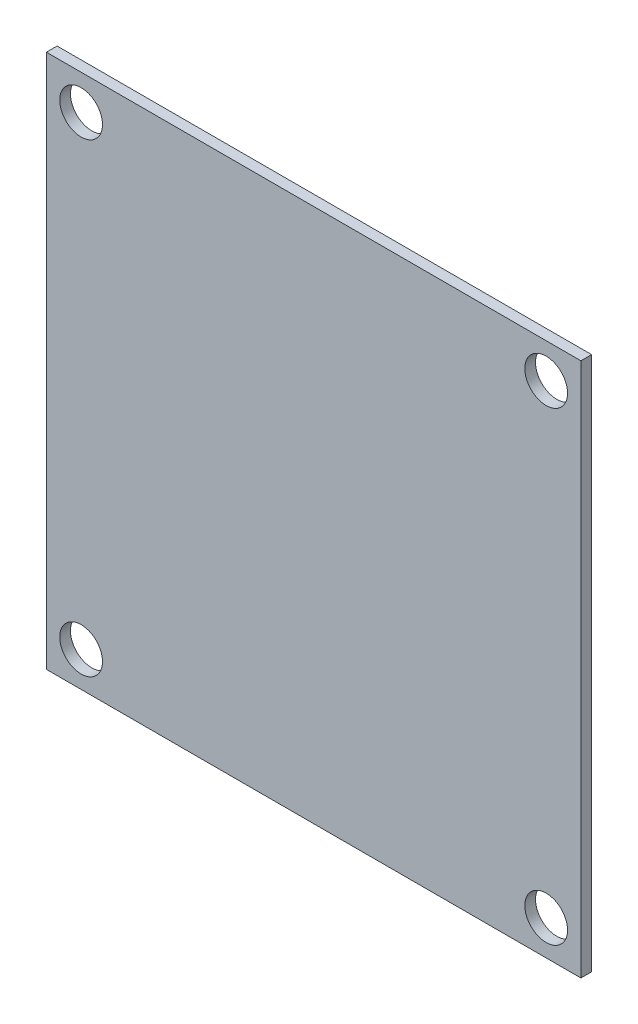
ISO-10303-21;
HEADER;
FILE_DESCRIPTION(('STEP AP214'),'2;1');
FILE_NAME('part.step','',(''),(''),'','','');
FILE_SCHEMA(('AUTOMOTIVE_DESIGN { 1 0 10303 214 1 1 1 1 }'));
ENDSEC;
DATA;
#1=APPLICATION_CONTEXT('core data for automotive mechanical design processes');
#2=APPLICATION_PROTOCOL_DEFINITION('international standard','automotive_design',2000,#1);
#3=PRODUCT_CONTEXT('',#1,'mechanical');
#4=PRODUCT('Part','Part','',(#3));
#5=PRODUCT_RELATED_PRODUCT_CATEGORY('part','',(#4));
#6=PRODUCT_DEFINITION_FORMATION('','',#4);
#7=PRODUCT_DEFINITION_CONTEXT('part definition',#1,'design');
#8=PRODUCT_DEFINITION('design','',#6,#7);
#9=PRODUCT_DEFINITION_SHAPE('','',#8);
#10=(LENGTH_UNIT() NAMED_UNIT(*) SI_UNIT(.MILLI.,.METRE.));
#11=(NAMED_UNIT(*) PLANE_ANGLE_UNIT() SI_UNIT($,.RADIAN.));
#12=(NAMED_UNIT(*) SI_UNIT($,.STERADIAN.) SOLID_ANGLE_UNIT());
#13=UNCERTAINTY_MEASURE_WITH_UNIT(LENGTH_MEASURE(1.E-05),#10,'distance_accuracy_value','');
#14=(GEOMETRIC_REPRESENTATION_CONTEXT(3) GLOBAL_UNCERTAINTY_ASSIGNED_CONTEXT((#13)) GLOBAL_UNIT_ASSIGNED_CONTEXT((#10,
#11,#12)) REPRESENTATION_CONTEXT('',''));
#15=CARTESIAN_POINT('',(0.,0.,0.));
#16=DIRECTION('',(0.,0.,1.));
#17=DIRECTION('',(1.,0.,0.));
#18=AXIS2_PLACEMENT_3D('',#15,#16,#17);
#19=CARTESIAN_POINT('',(0.,0.,0.8));
#20=DIRECTION('',(0.,0.,1.));
#21=DIRECTION('',(1.,0.,0.));
#22=AXIS2_PLACEMENT_3D('',#19,#20,#21);
#23=PLANE('',#22);
#24=CARTESIAN_POINT('',(17.4,17.4,0.8));
#25=DIRECTION('',(0.,0.,1.));
#26=DIRECTION('',(1.,0.,0.));
#27=AXIS2_PLACEMENT_3D('',#24,#25,#26);
#28=CIRCLE('',#27,1.6);
#29=CARTESIAN_POINT('',(19.,17.4,0.8));
#30=VERTEX_POINT('',#29);
#31=EDGE_CURVE('E120',#30,#30,#28,.T.);
#32=ORIENTED_EDGE('',*,*,#31,.F.);
#33=EDGE_LOOP('',(#32));
#34=FACE_BOUND('',#33,.T.);
#35=CARTESIAN_POINT('',(-17.4,-17.4,0.8));
#36=DIRECTION('',(0.,0.,1.));
#37=DIRECTION('',(1.,0.,0.));
#38=AXIS2_PLACEMENT_3D('',#35,#36,#37);
#39=CIRCLE('',#38,1.6);
#40=CARTESIAN_POINT('',(-15.8,-17.4,0.8));
#41=VERTEX_POINT('',#40);
#42=EDGE_CURVE('E99',#41,#41,#39,.T.);
#43=ORIENTED_EDGE('',*,*,#42,.F.);
#44=EDGE_LOOP('',(#43));
#45=FACE_BOUND('',#44,.T.);
#46=DIRECTION('',(0.,1.,0.));
#47=VECTOR('',#46,1.);
#48=CARTESIAN_POINT('',(20.,20.,0.8));
#49=LINE('',#48,#47);
#50=CARTESIAN_POINT('',(20.,-20.,0.8));
#51=VERTEX_POINT('',#50);
#52=CARTESIAN_POINT('',(20.,20.,0.8));
#53=VERTEX_POINT('',#52);
#54=EDGE_CURVE('E84',#51,#53,#49,.T.);
#55=ORIENTED_EDGE('',*,*,#54,.T.);
#56=DIRECTION('',(-1.,0.,0.));
#57=VECTOR('',#56,1.);
#58=CARTESIAN_POINT('',(-20.,20.,0.8));
#59=LINE('',#58,#57);
#60=CARTESIAN_POINT('',(-20.,20.,0.8));
#61=VERTEX_POINT('',#60);
#62=EDGE_CURVE('E79',#53,#61,#59,.T.);
#63=ORIENTED_EDGE('',*,*,#62,.T.);
#64=DIRECTION('',(0.,-1.,0.));
#65=VECTOR('',#64,1.);
#66=CARTESIAN_POINT('',(-20.,20.,0.8));
#67=LINE('',#66,#65);
#68=CARTESIAN_POINT('',(-20.,-20.,0.8));
#69=VERTEX_POINT('',#68);
#70=EDGE_CURVE('E82',#61,#69,#67,.T.);
#71=ORIENTED_EDGE('',*,*,#70,.T.);
#72=DIRECTION('',(1.,0.,0.));
#73=VECTOR('',#72,1.);
#74=CARTESIAN_POINT('',(-20.,-20.,0.8));
#75=LINE('',#74,#73);
#76=EDGE_CURVE('E49',#69,#51,#75,.T.);
#77=ORIENTED_EDGE('',*,*,#76,.T.);
#78=EDGE_LOOP('',(#55,#63,#71,#77));
#79=FACE_BOUND('',#78,.T.);
#80=CARTESIAN_POINT('',(-17.4,17.4,0.8));
#81=DIRECTION('',(0.,0.,1.));
#82=DIRECTION('',(1.,0.,0.));
#83=AXIS2_PLACEMENT_3D('',#80,#81,#82);
#84=CIRCLE('',#83,1.6);
#85=CARTESIAN_POINT('',(-15.8,17.4,0.8));
#86=VERTEX_POINT('',#85);
#87=EDGE_CURVE('E114',#86,#86,#84,.T.);
#88=ORIENTED_EDGE('',*,*,#87,.F.);
#89=EDGE_LOOP('',(#88));
#90=FACE_BOUND('',#89,.T.);
#91=CARTESIAN_POINT('',(17.4,-17.4,0.8));
#92=DIRECTION('',(0.,0.,1.));
#93=DIRECTION('',(1.,0.,0.));
#94=AXIS2_PLACEMENT_3D('',#91,#92,#93);
#95=CIRCLE('',#94,1.6);
#96=CARTESIAN_POINT('',(19.,-17.4,0.8));
#97=VERTEX_POINT('',#96);
#98=EDGE_CURVE('E126',#97,#97,#95,.T.);
#99=ORIENTED_EDGE('',*,*,#98,.F.);
#100=EDGE_LOOP('',(#99));
#101=FACE_BOUND('',#100,.T.);
#102=ADVANCED_FACE('F32',(#34,#45,#79,#90,#101),#23,.T.);
#103=CARTESIAN_POINT('',(0.,0.,0.));
#104=DIRECTION('',(0.,0.,1.));
#105=DIRECTION('',(1.,0.,0.));
#106=AXIS2_PLACEMENT_3D('',#103,#104,#105);
#107=PLANE('',#106);
#108=CARTESIAN_POINT('',(17.4,17.4,0.));
#109=DIRECTION('',(0.,0.,1.));
#110=DIRECTION('',(1.,0.,0.));
#111=AXIS2_PLACEMENT_3D('',#108,#109,#110);
#112=CIRCLE('',#111,1.6);
#113=CARTESIAN_POINT('',(19.,17.4,0.));
#114=VERTEX_POINT('',#113);
#115=EDGE_CURVE('E123',#114,#114,#112,.T.);
#116=ORIENTED_EDGE('',*,*,#115,.T.);
#117=EDGE_LOOP('',(#116));
#118=FACE_BOUND('',#117,.T.);
#119=CARTESIAN_POINT('',(-17.4,-17.4,0.));
#120=DIRECTION('',(0.,0.,1.));
#121=DIRECTION('',(1.,0.,0.));
#122=AXIS2_PLACEMENT_3D('',#119,#120,#121);
#123=CIRCLE('',#122,1.6);
#124=CARTESIAN_POINT('',(-15.8,-17.4,0.));
#125=VERTEX_POINT('',#124);
#126=EDGE_CURVE('E111',#125,#125,#123,.T.);
#127=ORIENTED_EDGE('',*,*,#126,.T.);
#128=EDGE_LOOP('',(#127));
#129=FACE_BOUND('',#128,.T.);
#130=DIRECTION('',(0.,1.,0.));
#131=VECTOR('',#130,1.);
#132=CARTESIAN_POINT('',(20.,20.,0.));
#133=LINE('',#132,#131);
#134=CARTESIAN_POINT('',(20.,-20.,0.));
#135=VERTEX_POINT('',#134);
#136=CARTESIAN_POINT('',(20.,20.,0.));
#137=VERTEX_POINT('',#136);
#138=EDGE_CURVE('E96',#135,#137,#133,.T.);
#139=ORIENTED_EDGE('',*,*,#138,.F.);
#140=DIRECTION('',(1.,0.,0.));
#141=VECTOR('',#140,1.);
#142=CARTESIAN_POINT('',(-20.,-20.,0.));
#143=LINE('',#142,#141);
#144=CARTESIAN_POINT('',(-20.,-20.,0.));
#145=VERTEX_POINT('',#144);
#146=EDGE_CURVE('E72',#145,#135,#143,.T.);
#147=ORIENTED_EDGE('',*,*,#146,.F.);
#148=DIRECTION('',(0.,-1.,0.));
#149=VECTOR('',#148,1.);
#150=CARTESIAN_POINT('',(-20.,20.,0.));
#151=LINE('',#150,#149);
#152=CARTESIAN_POINT('',(-20.,20.,0.));
#153=VERTEX_POINT('',#152);
#154=EDGE_CURVE('E66',#153,#145,#151,.T.);
#155=ORIENTED_EDGE('',*,*,#154,.F.);
#156=DIRECTION('',(-1.,0.,0.));
#157=VECTOR('',#156,1.);
#158=CARTESIAN_POINT('',(-20.,20.,0.));
#159=LINE('',#158,#157);
#160=EDGE_CURVE('E88',#137,#153,#159,.T.);
#161=ORIENTED_EDGE('',*,*,#160,.F.);
#162=EDGE_LOOP('',(#139,#147,#155,#161));
#163=FACE_BOUND('',#162,.T.);
#164=CARTESIAN_POINT('',(-17.4,17.4,0.));
#165=DIRECTION('',(0.,0.,1.));
#166=DIRECTION('',(1.,0.,0.));
#167=AXIS2_PLACEMENT_3D('',#164,#165,#166);
#168=CIRCLE('',#167,1.6);
#169=CARTESIAN_POINT('',(-15.8,17.4,0.));
#170=VERTEX_POINT('',#169);
#171=EDGE_CURVE('E117',#170,#170,#168,.T.);
#172=ORIENTED_EDGE('',*,*,#171,.T.);
#173=EDGE_LOOP('',(#172));
#174=FACE_BOUND('',#173,.T.);
#175=CARTESIAN_POINT('',(17.4,-17.4,0.));
#176=DIRECTION('',(0.,0.,1.));
#177=DIRECTION('',(1.,0.,0.));
#178=AXIS2_PLACEMENT_3D('',#175,#176,#177);
#179=CIRCLE('',#178,1.6);
#180=CARTESIAN_POINT('',(19.,-17.4,0.));
#181=VERTEX_POINT('',#180);
#182=EDGE_CURVE('E129',#181,#181,#179,.T.);
#183=ORIENTED_EDGE('',*,*,#182,.T.);
#184=EDGE_LOOP('',(#183));
#185=FACE_BOUND('',#184,.T.);
#186=ADVANCED_FACE('F107',(#118,#129,#163,#174,#185),#107,.F.);
#187=CARTESIAN_POINT('',(20.,20.,0.8));
#188=DIRECTION('',(-1.,0.,0.));
#189=DIRECTION('',(0.,-1.,0.));
#190=AXIS2_PLACEMENT_3D('',#187,#188,#189);
#191=PLANE('',#190);
#192=ORIENTED_EDGE('',*,*,#138,.T.);
#193=DIRECTION('',(0.,0.,-1.));
#194=VECTOR('',#193,1.);
#195=CARTESIAN_POINT('',(20.,20.,0.8));
#196=LINE('',#195,#194);
#197=EDGE_CURVE('E11',#53,#137,#196,.T.);
#198=ORIENTED_EDGE('',*,*,#197,.F.);
#199=ORIENTED_EDGE('',*,*,#54,.F.);
#200=DIRECTION('',(0.,0.,-1.));
#201=VECTOR('',#200,1.);
#202=CARTESIAN_POINT('',(20.,-20.,0.8));
#203=LINE('',#202,#201);
#204=EDGE_CURVE('E92',#51,#135,#203,.T.);
#205=ORIENTED_EDGE('',*,*,#204,.T.);
#206=EDGE_LOOP('',(#192,#198,#199,#205));
#207=FACE_BOUND('',#206,.T.);
#208=ADVANCED_FACE('F34',(#207),#191,.F.);
#209=CARTESIAN_POINT('',(-20.,20.,0.8));
#210=DIRECTION('',(0.,-1.,0.));
#211=DIRECTION('',(0.,0.,-1.));
#212=AXIS2_PLACEMENT_3D('',#209,#210,#211);
#213=PLANE('',#212);
#214=ORIENTED_EDGE('',*,*,#160,.T.);
#215=DIRECTION('',(0.,0.,-1.));
#216=VECTOR('',#215,1.);
#217=CARTESIAN_POINT('',(-20.,20.,0.8));
#218=LINE('',#217,#216);
#219=EDGE_CURVE('E41',#61,#153,#218,.T.);
#220=ORIENTED_EDGE('',*,*,#219,.F.);
#221=ORIENTED_EDGE('',*,*,#62,.F.);
#222=ORIENTED_EDGE('',*,*,#197,.T.);
#223=EDGE_LOOP('',(#214,#220,#221,#222));
#224=FACE_BOUND('',#223,.T.);
#225=ADVANCED_FACE('F87',(#224),#213,.F.);
#226=CARTESIAN_POINT('',(-20.,20.,0.8));
#227=DIRECTION('',(1.,0.,0.));
#228=DIRECTION('',(0.,1.,0.));
#229=AXIS2_PLACEMENT_3D('',#226,#227,#228);
#230=PLANE('',#229);
#231=ORIENTED_EDGE('',*,*,#154,.T.);
#232=DIRECTION('',(0.,0.,-1.));
#233=VECTOR('',#232,1.);
#234=CARTESIAN_POINT('',(-20.,-20.,0.8));
#235=LINE('',#234,#233);
#236=EDGE_CURVE('E89',#69,#145,#235,.T.);
#237=ORIENTED_EDGE('',*,*,#236,.F.);
#238=ORIENTED_EDGE('',*,*,#70,.F.);
#239=ORIENTED_EDGE('',*,*,#219,.T.);
#240=EDGE_LOOP('',(#231,#237,#238,#239));
#241=FACE_BOUND('',#240,.T.);
#242=ADVANCED_FACE('F90',(#241),#230,.F.);
#243=CARTESIAN_POINT('',(-20.,-20.,0.8));
#244=DIRECTION('',(0.,1.,0.));
#245=DIRECTION('',(0.,0.,1.));
#246=AXIS2_PLACEMENT_3D('',#243,#244,#245);
#247=PLANE('',#246);
#248=ORIENTED_EDGE('',*,*,#146,.T.);
#249=ORIENTED_EDGE('',*,*,#204,.F.);
#250=ORIENTED_EDGE('',*,*,#76,.F.);
#251=ORIENTED_EDGE('',*,*,#236,.T.);
#252=EDGE_LOOP('',(#248,#249,#250,#251));
#253=FACE_BOUND('',#252,.T.);
#254=ADVANCED_FACE('F104',(#253),#247,.F.);
#255=CARTESIAN_POINT('',(-17.4,-17.4,0.8));
#256=DIRECTION('',(0.,0.,-1.));
#257=DIRECTION('',(-1.,0.,0.));
#258=AXIS2_PLACEMENT_3D('',#255,#256,#257);
#259=CYLINDRICAL_SURFACE('',#258,1.6);
#260=ORIENTED_EDGE('',*,*,#42,.T.);
#261=EDGE_LOOP('',(#260));
#262=FACE_BOUND('',#261,.T.);
#263=ORIENTED_EDGE('',*,*,#126,.F.);
#264=EDGE_LOOP('',(#263));
#265=FACE_BOUND('',#264,.T.);
#266=ADVANCED_FACE('F149',(#262,#265),#259,.F.);
#267=CARTESIAN_POINT('',(-17.4,17.4,0.8));
#268=DIRECTION('',(0.,0.,-1.));
#269=DIRECTION('',(-1.,0.,0.));
#270=AXIS2_PLACEMENT_3D('',#267,#268,#269);
#271=CYLINDRICAL_SURFACE('',#270,1.6);
#272=ORIENTED_EDGE('',*,*,#87,.T.);
#273=EDGE_LOOP('',(#272));
#274=FACE_BOUND('',#273,.T.);
#275=ORIENTED_EDGE('',*,*,#171,.F.);
#276=EDGE_LOOP('',(#275));
#277=FACE_BOUND('',#276,.T.);
#278=ADVANCED_FACE('F178',(#274,#277),#271,.F.);
#279=CARTESIAN_POINT('',(17.4,17.4,0.8));
#280=DIRECTION('',(0.,0.,-1.));
#281=DIRECTION('',(-1.,0.,0.));
#282=AXIS2_PLACEMENT_3D('',#279,#280,#281);
#283=CYLINDRICAL_SURFACE('',#282,1.6);
#284=ORIENTED_EDGE('',*,*,#31,.T.);
#285=EDGE_LOOP('',(#284));
#286=FACE_BOUND('',#285,.T.);
#287=ORIENTED_EDGE('',*,*,#115,.F.);
#288=EDGE_LOOP('',(#287));
#289=FACE_BOUND('',#288,.T.);
#290=ADVANCED_FACE('F187',(#286,#289),#283,.F.);
#291=CARTESIAN_POINT('',(17.4,-17.4,0.8));
#292=DIRECTION('',(0.,0.,-1.));
#293=DIRECTION('',(-1.,0.,0.));
#294=AXIS2_PLACEMENT_3D('',#291,#292,#293);
#295=CYLINDRICAL_SURFACE('',#294,1.6);
#296=ORIENTED_EDGE('',*,*,#98,.T.);
#297=EDGE_LOOP('',(#296));
#298=FACE_BOUND('',#297,.T.);
#299=ORIENTED_EDGE('',*,*,#182,.F.);
#300=EDGE_LOOP('',(#299));
#301=FACE_BOUND('',#300,.T.);
#302=ADVANCED_FACE('F135',(#298,#301),#295,.F.);
#303=CLOSED_SHELL('',(#102,#186,#208,#225,#242,#254,#266,#278,#290,#302));
#304=MANIFOLD_SOLID_BREP('B2',#303);
#305=ADVANCED_BREP_SHAPE_REPRESENTATION('',(#18,#304),#14);
#306=SHAPE_DEFINITION_REPRESENTATION(#9,#305);
ENDSEC;
END-ISO-10303-21;
